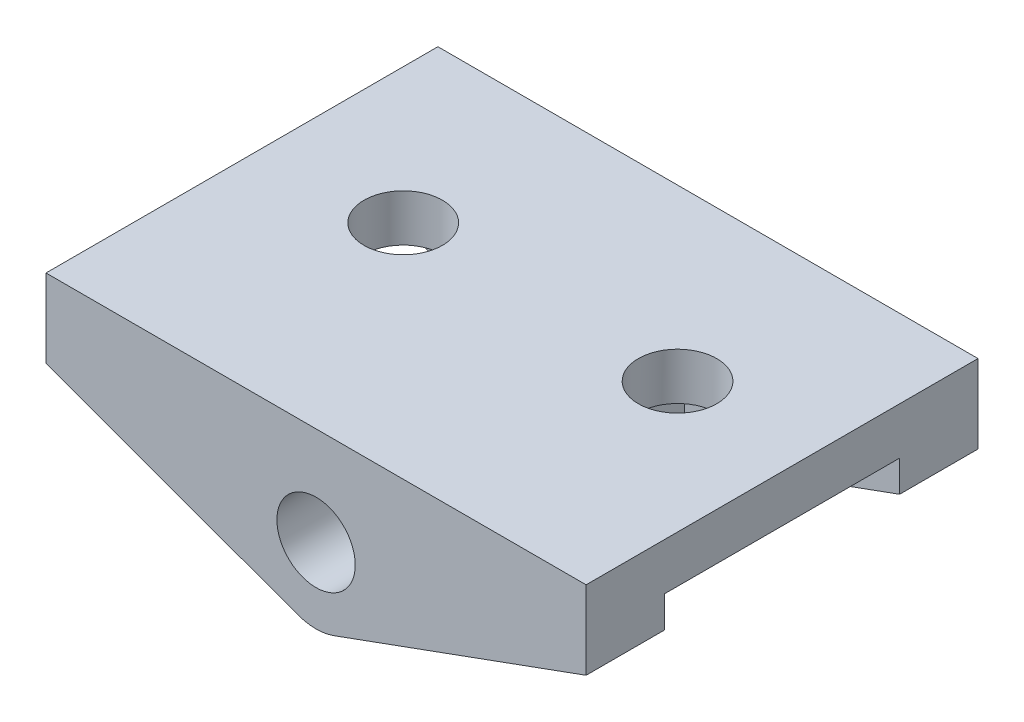
ISO-10303-21;
HEADER;
FILE_DESCRIPTION(('STEP AP214'),'2;1');
FILE_NAME('part.step','',(''),(''),'','','');
FILE_SCHEMA(('AUTOMOTIVE_DESIGN { 1 0 10303 214 1 1 1 1 }'));
ENDSEC;
DATA;
#1=APPLICATION_CONTEXT('core data for automotive mechanical design processes');
#2=APPLICATION_PROTOCOL_DEFINITION('international standard','automotive_design',2000,#1);
#3=PRODUCT_CONTEXT('',#1,'mechanical');
#4=PRODUCT('Part','Part','',(#3));
#5=PRODUCT_RELATED_PRODUCT_CATEGORY('part','',(#4));
#6=PRODUCT_DEFINITION_FORMATION('','',#4);
#7=PRODUCT_DEFINITION_CONTEXT('part definition',#1,'design');
#8=PRODUCT_DEFINITION('design','',#6,#7);
#9=PRODUCT_DEFINITION_SHAPE('','',#8);
#10=(LENGTH_UNIT() NAMED_UNIT(*) SI_UNIT(.MILLI.,.METRE.));
#11=(NAMED_UNIT(*) PLANE_ANGLE_UNIT() SI_UNIT($,.RADIAN.));
#12=(NAMED_UNIT(*) SI_UNIT($,.STERADIAN.) SOLID_ANGLE_UNIT());
#13=UNCERTAINTY_MEASURE_WITH_UNIT(LENGTH_MEASURE(1.E-05),#10,'distance_accuracy_value','');
#14=(GEOMETRIC_REPRESENTATION_CONTEXT(3) GLOBAL_UNCERTAINTY_ASSIGNED_CONTEXT((#13)) GLOBAL_UNIT_ASSIGNED_CONTEXT((#10,
#11,#12)) REPRESENTATION_CONTEXT('',''));
#15=CARTESIAN_POINT('',(0.,0.,0.));
#16=DIRECTION('',(0.,0.,1.));
#17=DIRECTION('',(1.,0.,0.));
#18=AXIS2_PLACEMENT_3D('',#15,#16,#17);
#19=CARTESIAN_POINT('',(10.336618828645,3.7622215765824,15.));
#20=DIRECTION('',(-1.,0.,0.));
#21=DIRECTION('',(0.,0.,1.));
#22=AXIS2_PLACEMENT_3D('',#19,#20,#21);
#23=PLANE('',#22);
#24=DIRECTION('',(0.,1.,0.));
#25=VECTOR('',#24,1.);
#26=CARTESIAN_POINT('',(10.336618828645,0.7622215765824,3.));
#27=LINE('',#26,#25);
#28=CARTESIAN_POINT('',(10.336618828645,0.7622215765824,3.));
#29=VERTEX_POINT('',#28);
#30=CARTESIAN_POINT('',(10.336618828645,1.9622215765824,3.));
#31=VERTEX_POINT('',#30);
#32=EDGE_CURVE('E251',#29,#31,#27,.T.);
#33=ORIENTED_EDGE('',*,*,#32,.F.);
#34=DIRECTION('',(0.,0.,-1.));
#35=VECTOR('',#34,1.);
#36=CARTESIAN_POINT('',(10.336618828645,0.7622215765824,15.));
#37=LINE('',#36,#35);
#38=CARTESIAN_POINT('',(10.336618828645,0.7622215765824,0.));
#39=VERTEX_POINT('',#38);
#40=EDGE_CURVE('E217',#29,#39,#37,.T.);
#41=ORIENTED_EDGE('',*,*,#40,.T.);
#42=DIRECTION('',(0.,1.,0.));
#43=VECTOR('',#42,1.);
#44=CARTESIAN_POINT('',(10.336618828645,3.7622215765824,0.));
#45=LINE('',#44,#43);
#46=CARTESIAN_POINT('',(10.336618828645,3.7622215765824,0.));
#47=VERTEX_POINT('',#46);
#48=EDGE_CURVE('E200',#39,#47,#45,.T.);
#49=ORIENTED_EDGE('',*,*,#48,.T.);
#50=DIRECTION('',(0.,0.,-1.));
#51=VECTOR('',#50,1.);
#52=CARTESIAN_POINT('',(10.336618828645,3.7622215765824,15.));
#53=LINE('',#52,#51);
#54=CARTESIAN_POINT('',(10.336618828645,3.7622215765824,15.));
#55=VERTEX_POINT('',#54);
#56=EDGE_CURVE('E11',#55,#47,#53,.T.);
#57=ORIENTED_EDGE('',*,*,#56,.F.);
#58=DIRECTION('',(0.,1.,0.));
#59=VECTOR('',#58,1.);
#60=CARTESIAN_POINT('',(10.336618828645,3.7622215765824,15.));
#61=LINE('',#60,#59);
#62=CARTESIAN_POINT('',(10.336618828645,0.7622215765824,15.));
#63=VERTEX_POINT('',#62);
#64=EDGE_CURVE('E203',#63,#55,#61,.T.);
#65=ORIENTED_EDGE('',*,*,#64,.F.);
#66=CARTESIAN_POINT('',(10.336618828645,0.7622215765824,12.));
#67=VERTEX_POINT('',#66);
#68=EDGE_CURVE('E229',#63,#67,#37,.T.);
#69=ORIENTED_EDGE('',*,*,#68,.T.);
#70=DIRECTION('',(0.,1.,0.));
#71=VECTOR('',#70,1.);
#72=CARTESIAN_POINT('',(10.336618828645,0.7622215765824,12.));
#73=LINE('',#72,#71);
#74=CARTESIAN_POINT('',(10.336618828645,1.9622215765824,12.));
#75=VERTEX_POINT('',#74);
#76=EDGE_CURVE('E56',#67,#75,#73,.T.);
#77=ORIENTED_EDGE('',*,*,#76,.T.);
#78=DIRECTION('',(0.,0.,1.));
#79=VECTOR('',#78,1.);
#80=CARTESIAN_POINT('',(10.336618828645,1.9622215765824,3.));
#81=LINE('',#80,#79);
#82=EDGE_CURVE('E186',#31,#75,#81,.T.);
#83=ORIENTED_EDGE('',*,*,#82,.F.);
#84=EDGE_LOOP('',(#33,#41,#49,#57,#65,#69,#77,#83));
#85=FACE_BOUND('',#84,.T.);
#86=ADVANCED_FACE('F32',(#85),#23,.F.);
#87=CARTESIAN_POINT('',(0.684040286651353,-2.75102969661998,15.));
#88=DIRECTION('',(-0.342020143325673,0.939692620785907,0.));
#89=DIRECTION('',(-0.939692620785907,-0.342020143325673,0.));
#90=AXIS2_PLACEMENT_3D('',#87,#88,#89);
#91=PLANE('',#90);
#92=DIRECTION('',(0.939692620785907,0.342020143325673,0.));
#93=VECTOR('',#92,1.);
#94=CARTESIAN_POINT('',(2.10341527579074,-2.23441944931133,3.));
#95=LINE('',#94,#93);
#96=CARTESIAN_POINT('',(2.10341527579074,-2.23441944931133,3.));
#97=VERTEX_POINT('',#96);
#98=EDGE_CURVE('E252',#97,#29,#95,.T.);
#99=ORIENTED_EDGE('',*,*,#98,.F.);
#100=DIRECTION('',(0.,0.,1.));
#101=VECTOR('',#100,1.);
#102=CARTESIAN_POINT('',(2.10341527579074,-2.23441944931133,3.));
#103=LINE('',#102,#101);
#104=CARTESIAN_POINT('',(2.10341527579074,-2.23441944931133,12.));
#105=VERTEX_POINT('',#104);
#106=EDGE_CURVE('E175',#97,#105,#103,.T.);
#107=ORIENTED_EDGE('',*,*,#106,.T.);
#108=DIRECTION('',(0.939692620785907,0.342020143325673,0.));
#109=VECTOR('',#108,1.);
#110=CARTESIAN_POINT('',(2.10341527579074,-2.23441944931133,12.));
#111=LINE('',#110,#109);
#112=EDGE_CURVE('E266',#105,#67,#111,.T.);
#113=ORIENTED_EDGE('',*,*,#112,.T.);
#114=ORIENTED_EDGE('',*,*,#68,.F.);
#115=DIRECTION('',(0.939692620785907,0.342020143325673,0.));
#116=VECTOR('',#115,1.);
#117=CARTESIAN_POINT('',(0.684040286651353,-2.75102969661998,15.));
#118=LINE('',#117,#116);
#119=CARTESIAN_POINT('',(0.684040286651354,-2.75102969661998,15.));
#120=VERTEX_POINT('',#119);
#121=EDGE_CURVE('E215',#120,#63,#118,.T.);
#122=ORIENTED_EDGE('',*,*,#121,.F.);
#123=DIRECTION('',(0.,0.,-1.));
#124=VECTOR('',#123,1.);
#125=CARTESIAN_POINT('',(0.684040286651354,-2.75102969661998,15.));
#126=LINE('',#125,#124);
#127=CARTESIAN_POINT('',(0.684040286651354,-2.75102969661998,0.));
#128=VERTEX_POINT('',#127);
#129=EDGE_CURVE('E168',#120,#128,#126,.T.);
#130=ORIENTED_EDGE('',*,*,#129,.T.);
#131=DIRECTION('',(0.939692620785907,0.342020143325673,0.));
#132=VECTOR('',#131,1.);
#133=CARTESIAN_POINT('',(0.684040286651353,-2.75102969661998,0.));
#134=LINE('',#133,#132);
#135=EDGE_CURVE('E207',#128,#39,#134,.T.);
#136=ORIENTED_EDGE('',*,*,#135,.T.);
#137=ORIENTED_EDGE('',*,*,#40,.F.);
#138=EDGE_LOOP('',(#99,#107,#113,#114,#122,#130,#136,#137));
#139=FACE_BOUND('',#138,.T.);
#140=ADVANCED_FACE('F235',(#139),#91,.F.);
#141=CARTESIAN_POINT('',(0.,-0.871644455048173,15.));
#142=DIRECTION('',(0.,0.,-1.));
#143=DIRECTION('',(-1.,0.,0.));
#144=AXIS2_PLACEMENT_3D('',#141,#142,#143);
#145=PLANE('',#144);
#146=ORIENTED_EDGE('',*,*,#64,.T.);
#147=DIRECTION('',(-1.,0.,0.));
#148=VECTOR('',#147,1.);
#149=CARTESIAN_POINT('',(-10.336618828645,3.7622215765824,15.));
#150=LINE('',#149,#148);
#151=CARTESIAN_POINT('',(-10.336618828645,3.7622215765824,15.));
#152=VERTEX_POINT('',#151);
#153=EDGE_CURVE('E206',#55,#152,#150,.T.);
#154=ORIENTED_EDGE('',*,*,#153,.T.);
#155=DIRECTION('',(0.,-1.,0.));
#156=VECTOR('',#155,1.);
#157=CARTESIAN_POINT('',(-10.336618828645,0.762221576582398,15.));
#158=LINE('',#157,#156);
#159=CARTESIAN_POINT('',(-10.336618828645,0.762221576582398,15.));
#160=VERTEX_POINT('',#159);
#161=EDGE_CURVE('E209',#152,#160,#158,.T.);
#162=ORIENTED_EDGE('',*,*,#161,.T.);
#163=DIRECTION('',(0.939692620785907,-0.342020143325672,0.));
#164=VECTOR('',#163,1.);
#165=CARTESIAN_POINT('',(-0.684040286651352,-2.75102969661998,15.));
#166=LINE('',#165,#164);
#167=CARTESIAN_POINT('',(-0.684040286651352,-2.75102969661998,15.));
#168=VERTEX_POINT('',#167);
#169=EDGE_CURVE('E211',#160,#168,#166,.T.);
#170=ORIENTED_EDGE('',*,*,#169,.T.);
#171=CARTESIAN_POINT('',(0.,-0.871644455048173,15.));
#172=DIRECTION('',(0.,0.,1.));
#173=DIRECTION('',(-1.,0.,0.));
#174=AXIS2_PLACEMENT_3D('',#171,#172,#173);
#175=CIRCLE('',#174,2.);
#176=EDGE_CURVE('E213',#168,#120,#175,.T.);
#177=ORIENTED_EDGE('',*,*,#176,.T.);
#178=ORIENTED_EDGE('',*,*,#121,.T.);
#179=EDGE_LOOP('',(#146,#154,#162,#170,#177,#178));
#180=FACE_BOUND('',#179,.T.);
#181=CARTESIAN_POINT('',(0.,0.,15.));
#182=DIRECTION('',(0.,0.,1.));
#183=DIRECTION('',(1.,0.,0.));
#184=AXIS2_PLACEMENT_3D('',#181,#182,#183);
#185=CIRCLE('',#184,1.5);
#186=CARTESIAN_POINT('',(1.5,0.,15.));
#187=VERTEX_POINT('',#186);
#188=EDGE_CURVE('E197',#187,#187,#185,.T.);
#189=ORIENTED_EDGE('',*,*,#188,.F.);
#190=EDGE_LOOP('',(#189));
#191=FACE_BOUND('',#190,.T.);
#192=ADVANCED_FACE('F279',(#180,#191),#145,.F.);
#193=CARTESIAN_POINT('',(0.,-0.871644455048173,0.));
#194=DIRECTION('',(0.,0.,-1.));
#195=DIRECTION('',(-1.,0.,0.));
#196=AXIS2_PLACEMENT_3D('',#193,#194,#195);
#197=PLANE('',#196);
#198=ORIENTED_EDGE('',*,*,#48,.F.);
#199=ORIENTED_EDGE('',*,*,#135,.F.);
#200=CARTESIAN_POINT('',(0.,-0.871644455048173,0.));
#201=DIRECTION('',(0.,0.,1.));
#202=DIRECTION('',(-1.,0.,0.));
#203=AXIS2_PLACEMENT_3D('',#200,#201,#202);
#204=CIRCLE('',#203,2.);
#205=CARTESIAN_POINT('',(-0.684040286651352,-2.75102969661998,0.));
#206=VERTEX_POINT('',#205);
#207=EDGE_CURVE('E225',#206,#128,#204,.T.);
#208=ORIENTED_EDGE('',*,*,#207,.F.);
#209=DIRECTION('',(0.939692620785907,-0.342020143325672,0.));
#210=VECTOR('',#209,1.);
#211=CARTESIAN_POINT('',(-0.684040286651352,-2.75102969661998,0.));
#212=LINE('',#211,#210);
#213=CARTESIAN_POINT('',(-10.336618828645,0.762221576582398,0.));
#214=VERTEX_POINT('',#213);
#215=EDGE_CURVE('E223',#214,#206,#212,.T.);
#216=ORIENTED_EDGE('',*,*,#215,.F.);
#217=DIRECTION('',(0.,-1.,0.));
#218=VECTOR('',#217,1.);
#219=CARTESIAN_POINT('',(-10.336618828645,0.762221576582398,0.));
#220=LINE('',#219,#218);
#221=CARTESIAN_POINT('',(-10.336618828645,3.7622215765824,0.));
#222=VERTEX_POINT('',#221);
#223=EDGE_CURVE('E161',#222,#214,#220,.T.);
#224=ORIENTED_EDGE('',*,*,#223,.F.);
#225=DIRECTION('',(-1.,0.,0.));
#226=VECTOR('',#225,1.);
#227=CARTESIAN_POINT('',(-10.336618828645,3.7622215765824,0.));
#228=LINE('',#227,#226);
#229=EDGE_CURVE('E220',#47,#222,#228,.T.);
#230=ORIENTED_EDGE('',*,*,#229,.F.);
#231=EDGE_LOOP('',(#198,#199,#208,#216,#224,#230));
#232=FACE_BOUND('',#231,.T.);
#233=CARTESIAN_POINT('',(0.,0.,0.));
#234=DIRECTION('',(0.,0.,1.));
#235=DIRECTION('',(1.,0.,0.));
#236=AXIS2_PLACEMENT_3D('',#233,#234,#235);
#237=CIRCLE('',#236,1.5);
#238=CARTESIAN_POINT('',(1.5,0.,0.));
#239=VERTEX_POINT('',#238);
#240=EDGE_CURVE('E196',#239,#239,#237,.T.);
#241=ORIENTED_EDGE('',*,*,#240,.T.);
#242=EDGE_LOOP('',(#241));
#243=FACE_BOUND('',#242,.T.);
#244=ADVANCED_FACE('F243',(#232,#243),#197,.T.);
#245=CARTESIAN_POINT('',(-10.336618828645,3.7622215765824,15.));
#246=DIRECTION('',(0.,-1.,0.));
#247=DIRECTION('',(0.,0.,-1.));
#248=AXIS2_PLACEMENT_3D('',#245,#246,#247);
#249=PLANE('',#248);
#250=CARTESIAN_POINT('',(-5.16338117135503,3.7622215765824,6.5));
#251=DIRECTION('',(0.,1.,0.));
#252=DIRECTION('',(0.,0.,1.));
#253=AXIS2_PLACEMENT_3D('',#250,#251,#252);
#254=CIRCLE('',#253,1.5);
#255=CARTESIAN_POINT('',(-5.16338117135503,3.7622215765824,8.));
#256=VERTEX_POINT('',#255);
#257=EDGE_CURVE('E174',#256,#256,#254,.T.);
#258=ORIENTED_EDGE('',*,*,#257,.F.);
#259=EDGE_LOOP('',(#258));
#260=FACE_BOUND('',#259,.T.);
#261=CARTESIAN_POINT('',(5.33661882864497,3.7622215765824,6.5));
#262=DIRECTION('',(0.,1.,0.));
#263=DIRECTION('',(0.,0.,1.));
#264=AXIS2_PLACEMENT_3D('',#261,#262,#263);
#265=CIRCLE('',#264,1.5);
#266=CARTESIAN_POINT('',(5.33661882864497,3.7622215765824,8.));
#267=VERTEX_POINT('',#266);
#268=EDGE_CURVE('E179',#267,#267,#265,.T.);
#269=ORIENTED_EDGE('',*,*,#268,.F.);
#270=EDGE_LOOP('',(#269));
#271=FACE_BOUND('',#270,.T.);
#272=ORIENTED_EDGE('',*,*,#229,.T.);
#273=DIRECTION('',(0.,0.,-1.));
#274=VECTOR('',#273,1.);
#275=CARTESIAN_POINT('',(-10.336618828645,3.7622215765824,15.));
#276=LINE('',#275,#274);
#277=EDGE_CURVE('E40',#152,#222,#276,.T.);
#278=ORIENTED_EDGE('',*,*,#277,.F.);
#279=ORIENTED_EDGE('',*,*,#153,.F.);
#280=ORIENTED_EDGE('',*,*,#56,.T.);
#281=EDGE_LOOP('',(#272,#278,#279,#280));
#282=FACE_BOUND('',#281,.T.);
#283=ADVANCED_FACE('F330',(#260,#271,#282),#249,.F.);
#284=CARTESIAN_POINT('',(-10.336618828645,0.762221576582398,15.));
#285=DIRECTION('',(1.,0.,0.));
#286=DIRECTION('',(0.,0.,-1.));
#287=AXIS2_PLACEMENT_3D('',#284,#285,#286);
#288=PLANE('',#287);
#289=DIRECTION('',(0.,0.,-1.));
#290=VECTOR('',#289,1.);
#291=CARTESIAN_POINT('',(-10.336618828645,0.762221576582398,15.));
#292=LINE('',#291,#290);
#293=CARTESIAN_POINT('',(-10.336618828645,0.762221576582398,3.));
#294=VERTEX_POINT('',#293);
#295=EDGE_CURVE('E152',#294,#214,#292,.T.);
#296=ORIENTED_EDGE('',*,*,#295,.F.);
#297=DIRECTION('',(0.,-1.,0.));
#298=VECTOR('',#297,1.);
#299=CARTESIAN_POINT('',(-10.336618828645,0.762221576582398,3.));
#300=LINE('',#299,#298);
#301=CARTESIAN_POINT('',(-10.336618828645,1.9622215765824,3.));
#302=VERTEX_POINT('',#301);
#303=EDGE_CURVE('E137',#302,#294,#300,.T.);
#304=ORIENTED_EDGE('',*,*,#303,.F.);
#305=DIRECTION('',(0.,0.,1.));
#306=VECTOR('',#305,1.);
#307=CARTESIAN_POINT('',(-10.336618828645,1.9622215765824,3.));
#308=LINE('',#307,#306);
#309=CARTESIAN_POINT('',(-10.336618828645,1.9622215765824,12.));
#310=VERTEX_POINT('',#309);
#311=EDGE_CURVE('E290',#302,#310,#308,.T.);
#312=ORIENTED_EDGE('',*,*,#311,.T.);
#313=DIRECTION('',(0.,-1.,0.));
#314=VECTOR('',#313,1.);
#315=CARTESIAN_POINT('',(-10.336618828645,0.762221576582398,12.));
#316=LINE('',#315,#314);
#317=CARTESIAN_POINT('',(-10.336618828645,0.762221576582398,12.));
#318=VERTEX_POINT('',#317);
#319=EDGE_CURVE('E289',#310,#318,#316,.T.);
#320=ORIENTED_EDGE('',*,*,#319,.T.);
#321=EDGE_CURVE('E163',#160,#318,#292,.T.);
#322=ORIENTED_EDGE('',*,*,#321,.F.);
#323=ORIENTED_EDGE('',*,*,#161,.F.);
#324=ORIENTED_EDGE('',*,*,#277,.T.);
#325=ORIENTED_EDGE('',*,*,#223,.T.);
#326=EDGE_LOOP('',(#296,#304,#312,#320,#322,#323,#324,#325));
#327=FACE_BOUND('',#326,.T.);
#328=ADVANCED_FACE('F158',(#327),#288,.F.);
#329=CARTESIAN_POINT('',(-0.684040286651352,-2.75102969661998,15.));
#330=DIRECTION('',(0.342020143325673,0.939692620785907,0.));
#331=DIRECTION('',(-0.939692620785907,0.342020143325673,0.));
#332=AXIS2_PLACEMENT_3D('',#329,#330,#331);
#333=PLANE('',#332);
#334=DIRECTION('',(0.,0.,1.));
#335=VECTOR('',#334,1.);
#336=CARTESIAN_POINT('',(-2.09418657028121,-2.2377784234176,3.));
#337=LINE('',#336,#335);
#338=CARTESIAN_POINT('',(-2.09418657028121,-2.2377784234176,3.));
#339=VERTEX_POINT('',#338);
#340=CARTESIAN_POINT('',(-2.09418657028121,-2.2377784234176,12.));
#341=VERTEX_POINT('',#340);
#342=EDGE_CURVE('E155',#339,#341,#337,.T.);
#343=ORIENTED_EDGE('',*,*,#342,.F.);
#344=DIRECTION('',(0.939692620785907,-0.342020143325672,0.));
#345=VECTOR('',#344,1.);
#346=CARTESIAN_POINT('',(-10.336618828645,0.762221576582398,3.));
#347=LINE('',#346,#345);
#348=EDGE_CURVE('E141',#294,#339,#347,.T.);
#349=ORIENTED_EDGE('',*,*,#348,.F.);
#350=ORIENTED_EDGE('',*,*,#295,.T.);
#351=ORIENTED_EDGE('',*,*,#215,.T.);
#352=DIRECTION('',(0.,0.,-1.));
#353=VECTOR('',#352,1.);
#354=CARTESIAN_POINT('',(-0.684040286651352,-2.75102969661998,15.));
#355=LINE('',#354,#353);
#356=EDGE_CURVE('E164',#168,#206,#355,.T.);
#357=ORIENTED_EDGE('',*,*,#356,.F.);
#358=ORIENTED_EDGE('',*,*,#169,.F.);
#359=ORIENTED_EDGE('',*,*,#321,.T.);
#360=DIRECTION('',(0.939692620785907,-0.342020143325672,0.));
#361=VECTOR('',#360,1.);
#362=CARTESIAN_POINT('',(-10.336618828645,0.762221576582398,12.));
#363=LINE('',#362,#361);
#364=EDGE_CURVE('E286',#318,#341,#363,.T.);
#365=ORIENTED_EDGE('',*,*,#364,.T.);
#366=EDGE_LOOP('',(#343,#349,#350,#351,#357,#358,#359,#365));
#367=FACE_BOUND('',#366,.T.);
#368=ADVANCED_FACE('F151',(#367),#333,.F.);
#369=CARTESIAN_POINT('',(0.,-0.871644455048173,15.));
#370=DIRECTION('',(0.,0.,-1.));
#371=DIRECTION('',(-1.,0.,0.));
#372=AXIS2_PLACEMENT_3D('',#369,#370,#371);
#373=CYLINDRICAL_SURFACE('',#372,2.);
#374=ORIENTED_EDGE('',*,*,#207,.T.);
#375=ORIENTED_EDGE('',*,*,#129,.F.);
#376=ORIENTED_EDGE('',*,*,#176,.F.);
#377=ORIENTED_EDGE('',*,*,#356,.T.);
#378=EDGE_LOOP('',(#374,#375,#376,#377));
#379=FACE_BOUND('',#378,.T.);
#380=ADVANCED_FACE('F284',(#379),#373,.T.);
#381=CARTESIAN_POINT('',(0.,0.,15.));
#382=DIRECTION('',(0.,0.,-1.));
#383=DIRECTION('',(-1.,0.,0.));
#384=AXIS2_PLACEMENT_3D('',#381,#382,#383);
#385=CYLINDRICAL_SURFACE('',#384,1.5);
#386=ORIENTED_EDGE('',*,*,#188,.T.);
#387=EDGE_LOOP('',(#386));
#388=FACE_BOUND('',#387,.T.);
#389=ORIENTED_EDGE('',*,*,#240,.F.);
#390=EDGE_LOOP('',(#389));
#391=FACE_BOUND('',#390,.T.);
#392=ADVANCED_FACE('F326',(#388,#391),#385,.F.);
#393=CARTESIAN_POINT('',(5.33661882864497,-2.87164445504817,6.5));
#394=DIRECTION('',(0.,1.,0.));
#395=DIRECTION('',(0.,0.,1.));
#396=AXIS2_PLACEMENT_3D('',#393,#394,#395);
#397=CYLINDRICAL_SURFACE('',#396,1.5);
#398=CARTESIAN_POINT('',(5.33661882864497,1.9622215765824,6.5));
#399=DIRECTION('',(0.,1.,0.));
#400=DIRECTION('',(-1.,0.,0.));
#401=AXIS2_PLACEMENT_3D('',#398,#399,#400);
#402=CIRCLE('',#401,1.5);
#403=CARTESIAN_POINT('',(3.83661882864497,1.9622215765824,6.5));
#404=VERTEX_POINT('',#403);
#405=EDGE_CURVE('E172',#404,#404,#402,.F.);
#406=ORIENTED_EDGE('',*,*,#405,.T.);
#407=EDGE_LOOP('',(#406));
#408=FACE_BOUND('',#407,.T.);
#409=ORIENTED_EDGE('',*,*,#268,.T.);
#410=EDGE_LOOP('',(#409));
#411=FACE_BOUND('',#410,.T.);
#412=ADVANCED_FACE('F341',(#408,#411),#397,.F.);
#413=CARTESIAN_POINT('',(-5.16338117135503,-2.87164445504817,6.5));
#414=DIRECTION('',(0.,1.,0.));
#415=DIRECTION('',(0.,0.,1.));
#416=AXIS2_PLACEMENT_3D('',#413,#414,#415);
#417=CYLINDRICAL_SURFACE('',#416,1.5);
#418=CARTESIAN_POINT('',(-5.16338117135503,1.9622215765824,6.5));
#419=DIRECTION('',(0.,1.,0.));
#420=DIRECTION('',(0.,0.,1.));
#421=AXIS2_PLACEMENT_3D('',#418,#419,#420);
#422=CIRCLE('',#421,1.5);
#423=CARTESIAN_POINT('',(-5.16338117135503,1.9622215765824,8.));
#424=VERTEX_POINT('',#423);
#425=EDGE_CURVE('E35',#424,#424,#422,.F.);
#426=ORIENTED_EDGE('',*,*,#425,.T.);
#427=EDGE_LOOP('',(#426));
#428=FACE_BOUND('',#427,.T.);
#429=ORIENTED_EDGE('',*,*,#257,.T.);
#430=EDGE_LOOP('',(#429));
#431=FACE_BOUND('',#430,.T.);
#432=ADVANCED_FACE('F343',(#428,#431),#417,.F.);
#433=CARTESIAN_POINT('',(10.336618828645,1.9622215765824,3.));
#434=DIRECTION('',(0.,1.,0.));
#435=DIRECTION('',(-1.,0.,0.));
#436=AXIS2_PLACEMENT_3D('',#433,#434,#435);
#437=PLANE('',#436);
#438=DIRECTION('',(-1.,0.,0.));
#439=VECTOR('',#438,1.);
#440=CARTESIAN_POINT('',(10.336618828645,1.9622215765824,12.));
#441=LINE('',#440,#439);
#442=CARTESIAN_POINT('',(2.10341527579074,1.9622215765824,12.));
#443=VERTEX_POINT('',#442);
#444=EDGE_CURVE('E259',#75,#443,#441,.T.);
#445=ORIENTED_EDGE('',*,*,#444,.T.);
#446=DIRECTION('',(0.,0.,1.));
#447=VECTOR('',#446,1.);
#448=CARTESIAN_POINT('',(2.10341527579074,1.9622215765824,3.));
#449=LINE('',#448,#447);
#450=CARTESIAN_POINT('',(2.10341527579074,1.9622215765824,3.));
#451=VERTEX_POINT('',#450);
#452=EDGE_CURVE('E182',#451,#443,#449,.T.);
#453=ORIENTED_EDGE('',*,*,#452,.F.);
#454=DIRECTION('',(-1.,0.,0.));
#455=VECTOR('',#454,1.);
#456=CARTESIAN_POINT('',(10.336618828645,1.9622215765824,3.));
#457=LINE('',#456,#455);
#458=EDGE_CURVE('E256',#31,#451,#457,.T.);
#459=ORIENTED_EDGE('',*,*,#458,.F.);
#460=ORIENTED_EDGE('',*,*,#82,.T.);
#461=EDGE_LOOP('',(#445,#453,#459,#460));
#462=FACE_BOUND('',#461,.T.);
#463=ORIENTED_EDGE('',*,*,#405,.F.);
#464=EDGE_LOOP('',(#463));
#465=FACE_BOUND('',#464,.T.);
#466=ADVANCED_FACE('F271',(#462,#465),#437,.F.);
#467=CARTESIAN_POINT('',(2.10341527579074,1.9622215765824,3.));
#468=DIRECTION('',(-1.,0.,0.));
#469=DIRECTION('',(0.,0.,1.));
#470=AXIS2_PLACEMENT_3D('',#467,#468,#469);
#471=PLANE('',#470);
#472=DIRECTION('',(0.,-1.,0.));
#473=VECTOR('',#472,1.);
#474=CARTESIAN_POINT('',(2.10341527579074,1.9622215765824,12.));
#475=LINE('',#474,#473);
#476=EDGE_CURVE('E189',#443,#105,#475,.T.);
#477=ORIENTED_EDGE('',*,*,#476,.T.);
#478=ORIENTED_EDGE('',*,*,#106,.F.);
#479=DIRECTION('',(0.,-1.,0.));
#480=VECTOR('',#479,1.);
#481=CARTESIAN_POINT('',(2.10341527579074,1.9622215765824,3.));
#482=LINE('',#481,#480);
#483=EDGE_CURVE('E192',#451,#97,#482,.T.);
#484=ORIENTED_EDGE('',*,*,#483,.F.);
#485=ORIENTED_EDGE('',*,*,#452,.T.);
#486=EDGE_LOOP('',(#477,#478,#484,#485));
#487=FACE_BOUND('',#486,.T.);
#488=ADVANCED_FACE('F275',(#487),#471,.F.);
#489=CARTESIAN_POINT('',(0.,0.,3.));
#490=DIRECTION('',(0.,0.,1.));
#491=DIRECTION('',(1.,0.,0.));
#492=AXIS2_PLACEMENT_3D('',#489,#490,#491);
#493=PLANE('',#492);
#494=ORIENTED_EDGE('',*,*,#98,.T.);
#495=ORIENTED_EDGE('',*,*,#32,.T.);
#496=ORIENTED_EDGE('',*,*,#458,.T.);
#497=ORIENTED_EDGE('',*,*,#483,.T.);
#498=EDGE_LOOP('',(#494,#495,#496,#497));
#499=FACE_BOUND('',#498,.T.);
#500=ADVANCED_FACE('F277',(#499),#493,.T.);
#501=CARTESIAN_POINT('',(0.,0.,12.));
#502=DIRECTION('',(0.,0.,1.));
#503=DIRECTION('',(1.,0.,0.));
#504=AXIS2_PLACEMENT_3D('',#501,#502,#503);
#505=PLANE('',#504);
#506=ORIENTED_EDGE('',*,*,#112,.F.);
#507=ORIENTED_EDGE('',*,*,#476,.F.);
#508=ORIENTED_EDGE('',*,*,#444,.F.);
#509=ORIENTED_EDGE('',*,*,#76,.F.);
#510=EDGE_LOOP('',(#506,#507,#508,#509));
#511=FACE_BOUND('',#510,.T.);
#512=ADVANCED_FACE('F273',(#511),#505,.F.);
#513=CARTESIAN_POINT('',(-10.336618828645,1.9622215765824,3.));
#514=DIRECTION('',(0.,1.,0.));
#515=DIRECTION('',(0.,0.,1.));
#516=AXIS2_PLACEMENT_3D('',#513,#514,#515);
#517=PLANE('',#516);
#518=DIRECTION('',(-1.,0.,0.));
#519=VECTOR('',#518,1.);
#520=CARTESIAN_POINT('',(-10.336618828645,1.9622215765824,12.));
#521=LINE('',#520,#519);
#522=CARTESIAN_POINT('',(-2.09418657028121,1.9622215765824,12.));
#523=VERTEX_POINT('',#522);
#524=EDGE_CURVE('E148',#523,#310,#521,.T.);
#525=ORIENTED_EDGE('',*,*,#524,.T.);
#526=ORIENTED_EDGE('',*,*,#311,.F.);
#527=DIRECTION('',(-1.,0.,0.));
#528=VECTOR('',#527,1.);
#529=CARTESIAN_POINT('',(-10.336618828645,1.9622215765824,3.));
#530=LINE('',#529,#528);
#531=CARTESIAN_POINT('',(-2.09418657028121,1.9622215765824,3.));
#532=VERTEX_POINT('',#531);
#533=EDGE_CURVE('E144',#532,#302,#530,.T.);
#534=ORIENTED_EDGE('',*,*,#533,.F.);
#535=DIRECTION('',(0.,0.,1.));
#536=VECTOR('',#535,1.);
#537=CARTESIAN_POINT('',(-2.09418657028121,1.9622215765824,3.));
#538=LINE('',#537,#536);
#539=EDGE_CURVE('E299',#532,#523,#538,.T.);
#540=ORIENTED_EDGE('',*,*,#539,.T.);
#541=EDGE_LOOP('',(#525,#526,#534,#540));
#542=FACE_BOUND('',#541,.T.);
#543=ORIENTED_EDGE('',*,*,#425,.F.);
#544=EDGE_LOOP('',(#543));
#545=FACE_BOUND('',#544,.T.);
#546=ADVANCED_FACE('F302',(#542,#545),#517,.F.);
#547=CARTESIAN_POINT('',(-2.09418657028121,1.9622215765824,3.));
#548=DIRECTION('',(1.,0.,0.));
#549=DIRECTION('',(0.,1.,0.));
#550=AXIS2_PLACEMENT_3D('',#547,#548,#549);
#551=PLANE('',#550);
#552=DIRECTION('',(0.,1.,0.));
#553=VECTOR('',#552,1.);
#554=CARTESIAN_POINT('',(-2.09418657028121,1.9622215765824,12.));
#555=LINE('',#554,#553);
#556=EDGE_CURVE('E48',#341,#523,#555,.T.);
#557=ORIENTED_EDGE('',*,*,#556,.T.);
#558=ORIENTED_EDGE('',*,*,#539,.F.);
#559=DIRECTION('',(0.,1.,0.));
#560=VECTOR('',#559,1.);
#561=CARTESIAN_POINT('',(-2.09418657028121,1.9622215765824,3.));
#562=LINE('',#561,#560);
#563=EDGE_CURVE('E156',#339,#532,#562,.T.);
#564=ORIENTED_EDGE('',*,*,#563,.F.);
#565=ORIENTED_EDGE('',*,*,#342,.T.);
#566=EDGE_LOOP('',(#557,#558,#564,#565));
#567=FACE_BOUND('',#566,.T.);
#568=ADVANCED_FACE('F310',(#567),#551,.F.);
#569=CARTESIAN_POINT('',(0.,0.,3.));
#570=DIRECTION('',(0.,0.,-1.));
#571=DIRECTION('',(-1.,0.,0.));
#572=AXIS2_PLACEMENT_3D('',#569,#570,#571);
#573=PLANE('',#572);
#574=ORIENTED_EDGE('',*,*,#303,.T.);
#575=ORIENTED_EDGE('',*,*,#348,.T.);
#576=ORIENTED_EDGE('',*,*,#563,.T.);
#577=ORIENTED_EDGE('',*,*,#533,.T.);
#578=EDGE_LOOP('',(#574,#575,#576,#577));
#579=FACE_BOUND('',#578,.T.);
#580=ADVANCED_FACE('F139',(#579),#573,.F.);
#581=CARTESIAN_POINT('',(0.,0.,12.));
#582=DIRECTION('',(0.,0.,-1.));
#583=DIRECTION('',(-1.,0.,0.));
#584=AXIS2_PLACEMENT_3D('',#581,#582,#583);
#585=PLANE('',#584);
#586=ORIENTED_EDGE('',*,*,#319,.F.);
#587=ORIENTED_EDGE('',*,*,#524,.F.);
#588=ORIENTED_EDGE('',*,*,#556,.F.);
#589=ORIENTED_EDGE('',*,*,#364,.F.);
#590=EDGE_LOOP('',(#586,#587,#588,#589));
#591=FACE_BOUND('',#590,.T.);
#592=ADVANCED_FACE('F304',(#591),#585,.T.);
#593=CLOSED_SHELL('',(#86,#140,#192,#244,#283,#328,#368,#380,#392,#412,#432,#466,#488,#500,#512,
#546,#568,#580,#592));
#594=MANIFOLD_SOLID_BREP('B2',#593);
#595=ADVANCED_BREP_SHAPE_REPRESENTATION('',(#18,#594),#14);
#596=SHAPE_DEFINITION_REPRESENTATION(#9,#595);
ENDSEC;
END-ISO-10303-21;
